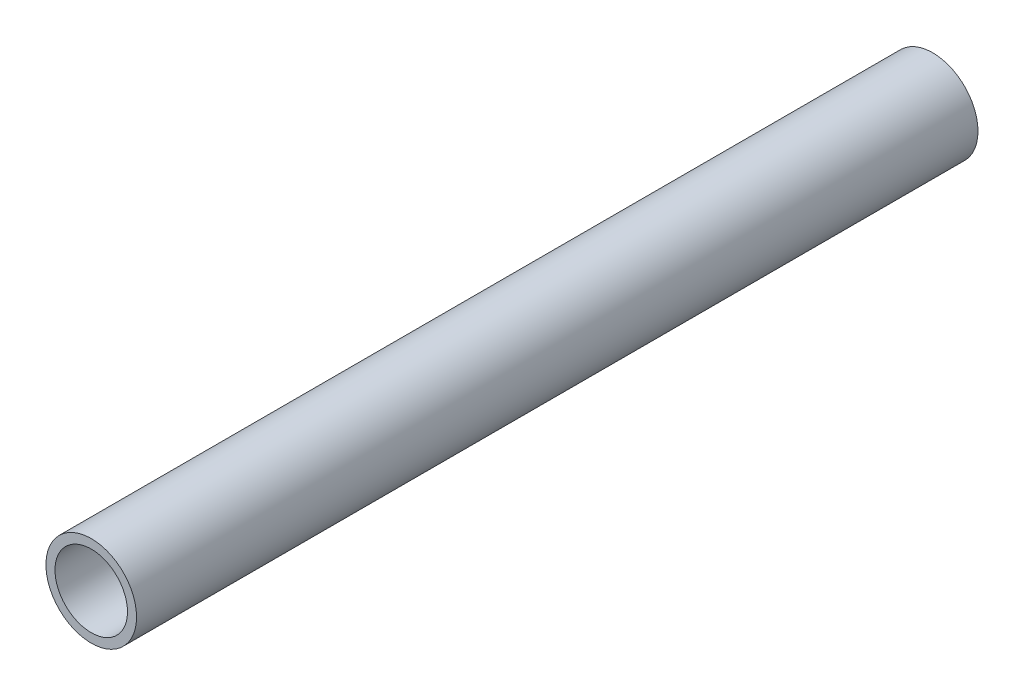
ISO-10303-21;
HEADER;
FILE_DESCRIPTION(('STEP AP214'),'2;1');
FILE_NAME('part.step','',(''),(''),'','','');
FILE_SCHEMA(('AUTOMOTIVE_DESIGN { 1 0 10303 214 1 1 1 1 }'));
ENDSEC;
DATA;
#1=APPLICATION_CONTEXT('core data for automotive mechanical design processes');
#2=APPLICATION_PROTOCOL_DEFINITION('international standard','automotive_design',2000,#1);
#3=PRODUCT_CONTEXT('',#1,'mechanical');
#4=PRODUCT('Part','Part','',(#3));
#5=PRODUCT_RELATED_PRODUCT_CATEGORY('part','',(#4));
#6=PRODUCT_DEFINITION_FORMATION('','',#4);
#7=PRODUCT_DEFINITION_CONTEXT('part definition',#1,'design');
#8=PRODUCT_DEFINITION('design','',#6,#7);
#9=PRODUCT_DEFINITION_SHAPE('','',#8);
#10=(LENGTH_UNIT() NAMED_UNIT(*) SI_UNIT(.MILLI.,.METRE.));
#11=(NAMED_UNIT(*) PLANE_ANGLE_UNIT() SI_UNIT($,.RADIAN.));
#12=(NAMED_UNIT(*) SI_UNIT($,.STERADIAN.) SOLID_ANGLE_UNIT());
#13=UNCERTAINTY_MEASURE_WITH_UNIT(LENGTH_MEASURE(1.E-05),#10,'distance_accuracy_value','');
#14=(GEOMETRIC_REPRESENTATION_CONTEXT(3) GLOBAL_UNCERTAINTY_ASSIGNED_CONTEXT((#13)) GLOBAL_UNIT_ASSIGNED_CONTEXT((#10,
#11,#12)) REPRESENTATION_CONTEXT('',''));
#15=CARTESIAN_POINT('',(0.,0.,0.));
#16=DIRECTION('',(0.,0.,1.));
#17=DIRECTION('',(1.,0.,0.));
#18=AXIS2_PLACEMENT_3D('',#15,#16,#17);
#19=CARTESIAN_POINT('',(0.,0.,23.21));
#20=DIRECTION('',(0.,0.,1.));
#21=DIRECTION('',(1.,0.,0.));
#22=AXIS2_PLACEMENT_3D('',#19,#20,#21);
#23=PLANE('',#22);
#24=CARTESIAN_POINT('',(0.,0.,23.21));
#25=DIRECTION('',(0.,0.,1.));
#26=DIRECTION('',(1.,0.,0.));
#27=AXIS2_PLACEMENT_3D('',#24,#25,#26);
#28=CIRCLE('',#27,1.25);
#29=CARTESIAN_POINT('',(1.25,0.,23.21));
#30=VERTEX_POINT('',#29);
#31=EDGE_CURVE('E10',#30,#30,#28,.T.);
#32=ORIENTED_EDGE('',*,*,#31,.T.);
#33=EDGE_LOOP('',(#32));
#34=FACE_BOUND('',#33,.T.);
#35=CARTESIAN_POINT('',(0.,0.,23.21));
#36=DIRECTION('',(0.,0.,1.));
#37=DIRECTION('',(1.,0.,0.));
#38=AXIS2_PLACEMENT_3D('',#35,#36,#37);
#39=CIRCLE('',#38,1.);
#40=CARTESIAN_POINT('',(1.,0.,23.21));
#41=VERTEX_POINT('',#40);
#42=EDGE_CURVE('E41',#41,#41,#39,.T.);
#43=ORIENTED_EDGE('',*,*,#42,.F.);
#44=EDGE_LOOP('',(#43));
#45=FACE_BOUND('',#44,.T.);
#46=ADVANCED_FACE('F30',(#34,#45),#23,.T.);
#47=CARTESIAN_POINT('',(0.,0.,0.));
#48=DIRECTION('',(0.,0.,1.));
#49=DIRECTION('',(1.,0.,0.));
#50=AXIS2_PLACEMENT_3D('',#47,#48,#49);
#51=PLANE('',#50);
#52=CARTESIAN_POINT('',(0.,0.,0.));
#53=DIRECTION('',(0.,0.,1.));
#54=DIRECTION('',(1.,0.,0.));
#55=AXIS2_PLACEMENT_3D('',#52,#53,#54);
#56=CIRCLE('',#55,1.25);
#57=CARTESIAN_POINT('',(1.25,0.,0.));
#58=VERTEX_POINT('',#57);
#59=EDGE_CURVE('E34',#58,#58,#56,.T.);
#60=ORIENTED_EDGE('',*,*,#59,.F.);
#61=EDGE_LOOP('',(#60));
#62=FACE_BOUND('',#61,.T.);
#63=CARTESIAN_POINT('',(0.,0.,0.));
#64=DIRECTION('',(0.,0.,1.));
#65=DIRECTION('',(1.,0.,0.));
#66=AXIS2_PLACEMENT_3D('',#63,#64,#65);
#67=CIRCLE('',#66,1.);
#68=CARTESIAN_POINT('',(1.,0.,0.));
#69=VERTEX_POINT('',#68);
#70=EDGE_CURVE('E43',#69,#69,#67,.T.);
#71=ORIENTED_EDGE('',*,*,#70,.T.);
#72=EDGE_LOOP('',(#71));
#73=FACE_BOUND('',#72,.T.);
#74=ADVANCED_FACE('F53',(#62,#73),#51,.F.);
#75=CARTESIAN_POINT('',(0.,0.,23.21));
#76=DIRECTION('',(0.,0.,-1.));
#77=DIRECTION('',(-1.,0.,0.));
#78=AXIS2_PLACEMENT_3D('',#75,#76,#77);
#79=CYLINDRICAL_SURFACE('',#78,1.25);
#80=ORIENTED_EDGE('',*,*,#31,.F.);
#81=EDGE_LOOP('',(#80));
#82=FACE_BOUND('',#81,.T.);
#83=ORIENTED_EDGE('',*,*,#59,.T.);
#84=EDGE_LOOP('',(#83));
#85=FACE_BOUND('',#84,.T.);
#86=ADVANCED_FACE('F32',(#82,#85),#79,.T.);
#87=CARTESIAN_POINT('',(0.,0.,23.21));
#88=DIRECTION('',(0.,0.,-1.));
#89=DIRECTION('',(-1.,0.,0.));
#90=AXIS2_PLACEMENT_3D('',#87,#88,#89);
#91=CYLINDRICAL_SURFACE('',#90,1.);
#92=ORIENTED_EDGE('',*,*,#42,.T.);
#93=EDGE_LOOP('',(#92));
#94=FACE_BOUND('',#93,.T.);
#95=ORIENTED_EDGE('',*,*,#70,.F.);
#96=EDGE_LOOP('',(#95));
#97=FACE_BOUND('',#96,.T.);
#98=ADVANCED_FACE('F49',(#94,#97),#91,.F.);
#99=CLOSED_SHELL('',(#46,#74,#86,#98));
#100=MANIFOLD_SOLID_BREP('B2',#99);
#101=ADVANCED_BREP_SHAPE_REPRESENTATION('',(#18,#100),#14);
#102=SHAPE_DEFINITION_REPRESENTATION(#9,#101);
ENDSEC;
END-ISO-10303-21;
